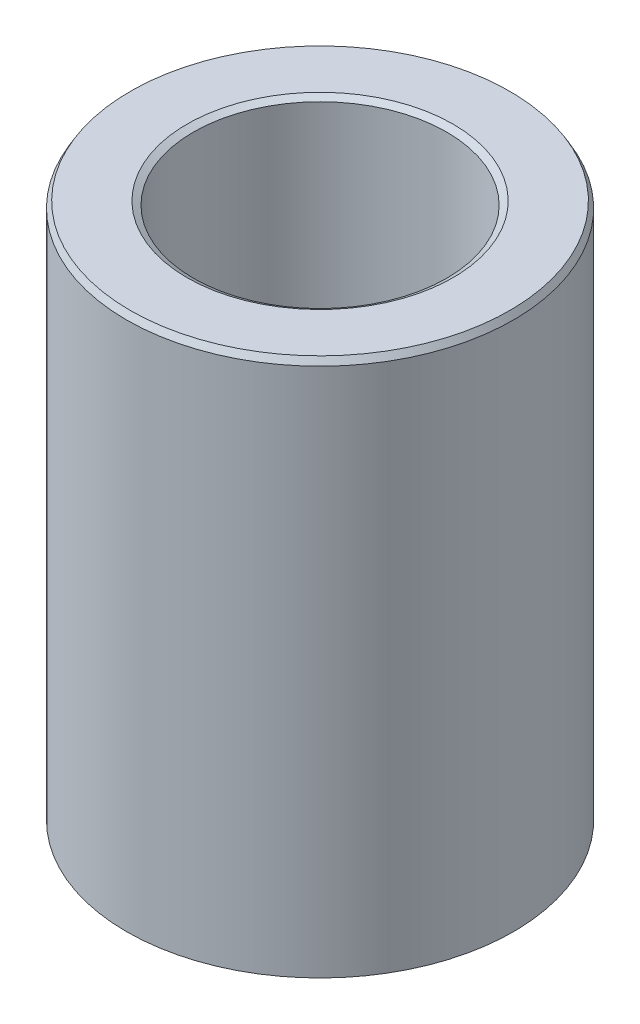
ISO-10303-21;
HEADER;
FILE_DESCRIPTION(('STEP AP214'),'2;1');
FILE_NAME('part.step','',(''),(''),'','','');
FILE_SCHEMA(('AUTOMOTIVE_DESIGN { 1 0 10303 214 1 1 1 1 }'));
ENDSEC;
DATA;
#1=APPLICATION_CONTEXT('core data for automotive mechanical design processes');
#2=APPLICATION_PROTOCOL_DEFINITION('international standard','automotive_design',2000,#1);
#3=PRODUCT_CONTEXT('',#1,'mechanical');
#4=PRODUCT('Part','Part','',(#3));
#5=PRODUCT_RELATED_PRODUCT_CATEGORY('part','',(#4));
#6=PRODUCT_DEFINITION_FORMATION('','',#4);
#7=PRODUCT_DEFINITION_CONTEXT('part definition',#1,'design');
#8=PRODUCT_DEFINITION('design','',#6,#7);
#9=PRODUCT_DEFINITION_SHAPE('','',#8);
#10=(LENGTH_UNIT() NAMED_UNIT(*) SI_UNIT(.MILLI.,.METRE.));
#11=(NAMED_UNIT(*) PLANE_ANGLE_UNIT() SI_UNIT($,.RADIAN.));
#12=(NAMED_UNIT(*) SI_UNIT($,.STERADIAN.) SOLID_ANGLE_UNIT());
#13=UNCERTAINTY_MEASURE_WITH_UNIT(LENGTH_MEASURE(1.E-05),#10,'distance_accuracy_value','');
#14=(GEOMETRIC_REPRESENTATION_CONTEXT(3) GLOBAL_UNCERTAINTY_ASSIGNED_CONTEXT((#13)) GLOBAL_UNIT_ASSIGNED_CONTEXT((#10,
#11,#12)) REPRESENTATION_CONTEXT('',''));
#15=CARTESIAN_POINT('',(0.,0.,0.));
#16=DIRECTION('',(0.,0.,1.));
#17=DIRECTION('',(1.,0.,0.));
#18=AXIS2_PLACEMENT_3D('',#15,#16,#17);
#19=CARTESIAN_POINT('',(0.,104.640393123507,0.));
#20=DIRECTION('',(0.,-1.,0.));
#21=DIRECTION('',(0.,0.,-1.));
#22=AXIS2_PLACEMENT_3D('',#19,#20,#21);
#23=CYLINDRICAL_SURFACE('',#22,37.5);
#24=CARTESIAN_POINT('',(0.,0.714431861445083,0.));
#25=DIRECTION('',(0.,1.,0.));
#26=DIRECTION('',(0.,0.,1.));
#27=AXIS2_PLACEMENT_3D('',#24,#25,#26);
#28=CIRCLE('',#27,37.5);
#29=CARTESIAN_POINT('',(0.,0.714431861445083,37.5));
#30=VERTEX_POINT('',#29);
#31=EDGE_CURVE('E10',#30,#30,#28,.T.);
#32=ORIENTED_EDGE('',*,*,#31,.T.);
#33=EDGE_LOOP('',(#32));
#34=FACE_BOUND('',#33,.T.);
#35=CARTESIAN_POINT('',(0.,103.402960840938,0.));
#36=DIRECTION('',(0.,1.,0.));
#37=DIRECTION('',(0.,0.,1.));
#38=AXIS2_PLACEMENT_3D('',#35,#36,#37);
#39=CIRCLE('',#38,37.5);
#40=CARTESIAN_POINT('',(0.,103.402960840938,37.5));
#41=VERTEX_POINT('',#40);
#42=EDGE_CURVE('E50',#41,#41,#39,.F.);
#43=ORIENTED_EDGE('',*,*,#42,.T.);
#44=EDGE_LOOP('',(#43));
#45=FACE_BOUND('',#44,.T.);
#46=ADVANCED_FACE('F39',(#34,#45),#23,.T.);
#47=CARTESIAN_POINT('',(0.,104.640393123507,0.));
#48=DIRECTION('',(0.,1.,0.));
#49=DIRECTION('',(0.,0.,1.));
#50=AXIS2_PLACEMENT_3D('',#47,#48,#49);
#51=PLANE('',#50);
#52=CARTESIAN_POINT('',(0.,104.640393123507,0.));
#53=DIRECTION('',(0.,1.,0.));
#54=DIRECTION('',(0.,0.,1.));
#55=AXIS2_PLACEMENT_3D('',#52,#53,#54);
#56=CIRCLE('',#55,25.7845045685845);
#57=CARTESIAN_POINT('',(0.,104.640393123507,25.7845045685845));
#58=VERTEX_POINT('',#57);
#59=EDGE_CURVE('E58',#58,#58,#56,.F.);
#60=ORIENTED_EDGE('',*,*,#59,.T.);
#61=EDGE_LOOP('',(#60));
#62=FACE_BOUND('',#61,.T.);
#63=CARTESIAN_POINT('',(0.,104.640393123507,0.));
#64=DIRECTION('',(0.,1.,0.));
#65=DIRECTION('',(0.,0.,1.));
#66=AXIS2_PLACEMENT_3D('',#63,#64,#65);
#67=CIRCLE('',#66,36.7855681385549);
#68=CARTESIAN_POINT('',(0.,104.640393123507,36.7855681385549));
#69=VERTEX_POINT('',#68);
#70=EDGE_CURVE('E61',#69,#69,#67,.T.);
#71=ORIENTED_EDGE('',*,*,#70,.T.);
#72=EDGE_LOOP('',(#71));
#73=FACE_BOUND('',#72,.T.);
#74=ADVANCED_FACE('F88',(#62,#73),#51,.T.);
#75=CARTESIAN_POINT('',(0.,0.,0.));
#76=DIRECTION('',(0.,1.,0.));
#77=DIRECTION('',(0.,0.,1.));
#78=AXIS2_PLACEMENT_3D('',#75,#76,#77);
#79=PLANE('',#78);
#80=CARTESIAN_POINT('',(0.,0.,0.));
#81=DIRECTION('',(0.,1.,0.));
#82=DIRECTION('',(0.,0.,1.));
#83=AXIS2_PLACEMENT_3D('',#80,#81,#82);
#84=CIRCLE('',#83,25.2615041474607);
#85=CARTESIAN_POINT('',(0.,0.,25.2615041474607));
#86=VERTEX_POINT('',#85);
#87=EDGE_CURVE('E51',#86,#86,#84,.T.);
#88=ORIENTED_EDGE('',*,*,#87,.T.);
#89=EDGE_LOOP('',(#88));
#90=FACE_BOUND('',#89,.T.);
#91=CARTESIAN_POINT('',(0.,0.,0.));
#92=DIRECTION('',(0.,1.,0.));
#93=DIRECTION('',(0.,0.,1.));
#94=AXIS2_PLACEMENT_3D('',#91,#92,#93);
#95=CIRCLE('',#94,36.2625677174311);
#96=CARTESIAN_POINT('',(0.,0.,36.2625677174311));
#97=VERTEX_POINT('',#96);
#98=EDGE_CURVE('E54',#97,#97,#95,.F.);
#99=ORIENTED_EDGE('',*,*,#98,.T.);
#100=EDGE_LOOP('',(#99));
#101=FACE_BOUND('',#100,.T.);
#102=ADVANCED_FACE('F83',(#90,#101),#79,.F.);
#103=CARTESIAN_POINT('',(0.,104.640393123507,0.));
#104=DIRECTION('',(0.,-1.,0.));
#105=DIRECTION('',(0.,0.,-1.));
#106=AXIS2_PLACEMENT_3D('',#103,#104,#105);
#107=CYLINDRICAL_SURFACE('',#106,24.5470722860156);
#108=CARTESIAN_POINT('',(0.,103.925961262062,0.));
#109=DIRECTION('',(0.,1.,0.));
#110=DIRECTION('',(0.,0.,1.));
#111=AXIS2_PLACEMENT_3D('',#108,#109,#110);
#112=CIRCLE('',#111,24.5470722860156);
#113=CARTESIAN_POINT('',(0.,103.925961262062,24.5470722860156));
#114=VERTEX_POINT('',#113);
#115=EDGE_CURVE('E67',#114,#114,#112,.T.);
#116=ORIENTED_EDGE('',*,*,#115,.T.);
#117=EDGE_LOOP('',(#116));
#118=FACE_BOUND('',#117,.T.);
#119=CARTESIAN_POINT('',(0.,1.23743228256894,0.));
#120=DIRECTION('',(0.,1.,0.));
#121=DIRECTION('',(0.,0.,1.));
#122=AXIS2_PLACEMENT_3D('',#119,#120,#121);
#123=CIRCLE('',#122,24.5470722860156);
#124=CARTESIAN_POINT('',(0.,1.23743228256894,24.5470722860156));
#125=VERTEX_POINT('',#124);
#126=EDGE_CURVE('E69',#125,#125,#123,.F.);
#127=ORIENTED_EDGE('',*,*,#126,.T.);
#128=EDGE_LOOP('',(#127));
#129=FACE_BOUND('',#128,.T.);
#130=ADVANCED_FACE('F71',(#118,#129),#107,.F.);
#131=CARTESIAN_POINT('',(0.,103.925961262062,0.));
#132=DIRECTION('',(0.,1.,0.));
#133=DIRECTION('',(0.,0.,1.));
#134=AXIS2_PLACEMENT_3D('',#131,#132,#133);
#135=CONICAL_SURFACE('',#134,24.5470722860156,1.0471975511966);
#136=CARTESIAN_POINT('',(0.,104.640393123507,25.7845045685845));
#137=CARTESIAN_POINT('',(0.,104.63295112495,25.7716146489744));
#138=CARTESIAN_POINT('',(0.,104.625509126394,25.7587247293643));
#139=CARTESIAN_POINT('',(0.,104.61062512928,25.7329448901441));
#140=CARTESIAN_POINT('',(0.,104.603183130724,25.720054970534));
#141=CARTESIAN_POINT('',(0.,104.58829913361,25.6942751313138));
#142=CARTESIAN_POINT('',(0.,104.580857135053,25.6813852117037));
#143=CARTESIAN_POINT('',(0.,104.56597313794,25.6556053724836));
#144=CARTESIAN_POINT('',(0.,104.558531139383,25.6427154528735));
#145=CARTESIAN_POINT('',(0.,104.54364714227,25.6169356136533));
#146=CARTESIAN_POINT('',(0.,104.536205143713,25.6040456940432));
#147=CARTESIAN_POINT('',(0.,104.5213211466,25.578265854823));
#148=CARTESIAN_POINT('',(0.,104.513879148043,25.5653759352129));
#149=CARTESIAN_POINT('',(0.,104.498995150929,25.5395960959927));
#150=CARTESIAN_POINT('',(0.,104.491553152373,25.5267061763826));
#151=CARTESIAN_POINT('',(0.,104.476669155259,25.5009263371625));
#152=CARTESIAN_POINT('',(0.,104.469227156703,25.4880364175524));
#153=CARTESIAN_POINT('',(0.,104.454343159589,25.4622565783322));
#154=CARTESIAN_POINT('',(0.,104.446901161032,25.4493666587221));
#155=CARTESIAN_POINT('',(0.,104.432017163919,25.4235868195019));
#156=CARTESIAN_POINT('',(0.,104.424575165362,25.4106968998918));
#157=CARTESIAN_POINT('',(0.,104.409691168249,25.3849170606716));
#158=CARTESIAN_POINT('',(0.,104.402249169692,25.3720271410615));
#159=CARTESIAN_POINT('',(0.,104.387365172579,25.3462473018413));
#160=CARTESIAN_POINT('',(0.,104.379923174022,25.3333573822313));
#161=CARTESIAN_POINT('',(0.,104.365039176909,25.3075775430111));
#162=CARTESIAN_POINT('',(0.,104.357597178352,25.294687623401));
#163=CARTESIAN_POINT('',(0.,104.342713181238,25.2689077841808));
#164=CARTESIAN_POINT('',(0.,104.335271182682,25.2560178645707));
#165=CARTESIAN_POINT('',(0.,104.320387185568,25.2302380253505));
#166=CARTESIAN_POINT('',(0.,104.312945187011,25.2173481057404));
#167=CARTESIAN_POINT('',(0.,104.298061189898,25.1915682665202));
#168=CARTESIAN_POINT('',(0.,104.290619191341,25.1786783469101));
#169=CARTESIAN_POINT('',(0.,104.275735194228,25.15289850769));
#170=CARTESIAN_POINT('',(0.,104.268293195671,25.1400085880799));
#171=CARTESIAN_POINT('',(0.,104.253409198558,25.1142287488597));
#172=CARTESIAN_POINT('',(0.,104.245967200001,25.1013388292496));
#173=CARTESIAN_POINT('',(0.,104.231083202888,25.0755589900294));
#174=CARTESIAN_POINT('',(0.,104.223641204331,25.0626690704193));
#175=CARTESIAN_POINT('',(0.,104.208757207217,25.0368892311991));
#176=CARTESIAN_POINT('',(0.,104.201315208661,25.023999311589));
#177=CARTESIAN_POINT('',(0.,104.186431211547,24.9982194723689));
#178=CARTESIAN_POINT('',(0.,104.178989212991,24.9853295527588));
#179=CARTESIAN_POINT('',(0.,104.164105215877,24.9595497135386));
#180=CARTESIAN_POINT('',(0.,104.15666321732,24.9466597939285));
#181=CARTESIAN_POINT('',(0.,104.141779220207,24.9208799547083));
#182=CARTESIAN_POINT('',(0.,104.13433722165,24.9079900350982));
#183=CARTESIAN_POINT('',(0.,104.119453224537,24.882210195878));
#184=CARTESIAN_POINT('',(0.,104.11201122598,24.8693202762679));
#185=CARTESIAN_POINT('',(0.,104.097127228867,24.8435404370477));
#186=CARTESIAN_POINT('',(0.,104.08968523031,24.8306505174376));
#187=CARTESIAN_POINT('',(0.,104.074801233196,24.8048706782175));
#188=CARTESIAN_POINT('',(0.,104.06735923464,24.7919807586074));
#189=CARTESIAN_POINT('',(0.,104.052475237526,24.7662009193872));
#190=CARTESIAN_POINT('',(0.,104.04503323897,24.7533109997771));
#191=CARTESIAN_POINT('',(0.,104.030149241856,24.7275311605569));
#192=CARTESIAN_POINT('',(0.,104.022707243299,24.7146412409468));
#193=CARTESIAN_POINT('',(0.,104.007823246186,24.6888614017266));
#194=CARTESIAN_POINT('',(0.,104.000381247629,24.6759714821165));
#195=CARTESIAN_POINT('',(0.,103.985497250516,24.6501916428964));
#196=CARTESIAN_POINT('',(0.,103.978055251959,24.6373017232863));
#197=CARTESIAN_POINT('',(0.,103.963171254846,24.6115218840661));
#198=CARTESIAN_POINT('',(0.,103.955729256289,24.598631964456));
#199=CARTESIAN_POINT('',(0.,103.940845259175,24.5728521252358));
#200=CARTESIAN_POINT('',(0.,103.933403260619,24.5599622056257));
#201=CARTESIAN_POINT('',(0.,103.925961262062,24.5470722860156));
#202=B_SPLINE_CURVE_WITH_KNOTS('',3,(#136,#137,#138,#139,#140,#141,#142,#143,#144,#145,#146,
#147,#148,#149,#150,#151,#152,#153,#154,#155,#156,#157,#158,#159,#160,#161,#162,#163,#164,#165,
#166,#167,#168,#169,#170,#171,#172,#173,#174,#175,#176,#177,#178,#179,#180,#181,#182,#183,#184,
#185,#186,#187,#188,#189,#190,#191,#192,#193,#194,#195,#196,#197,#198,#199,#200,#201),
.UNSPECIFIED.,.F.,.F.,(4,2,2,2,2,2,2,2,2,2,2,2,2,2,2,2,2,2,2,2,2,2,2,2,2,2,2,2,2,2,2,2,4),(0.,
0.0446519913403189,0.0893039826806377,0.133955974020957,0.178607965361272,0.223259956701591,
0.267911948041903,0.312563939382222,0.357215930722541,0.401867922062857,0.446519913403176,
0.491171904743488,0.535823896083807,0.580475887424125,0.625127878764441,0.66977987010476,
0.714431861445072,0.759083852785391,0.80373584412571,0.848387835466026,0.893039826806345,
0.937691818146664,0.982343809486976,1.02699580082729,1.07164779216761,1.11629978350793,
1.16095177484825,1.20560376618856,1.25025575752888,1.29490774886919,1.33955974020951,
1.38421173154983,1.42886372289014),.UNSPECIFIED.);
#203=EDGE_CURVE('BSEAM77',#58,#114,#202,.T.);
#204=ORIENTED_EDGE('',*,*,#59,.F.);
#205=ORIENTED_EDGE('',*,*,#115,.F.);
#206=ORIENTED_EDGE('',*,*,#203,.T.);
#207=ORIENTED_EDGE('',*,*,#203,.F.);
#208=EDGE_LOOP('',(#204,#206,#205,#207));
#209=FACE_BOUND('',#208,.T.);
#210=ADVANCED_FACE('F77',(#209),#135,.F.);
#211=CARTESIAN_POINT('',(0.,0.,0.));
#212=DIRECTION('',(0.,-1.,0.));
#213=DIRECTION('',(0.,0.,-1.));
#214=AXIS2_PLACEMENT_3D('',#211,#212,#213);
#215=CONICAL_SURFACE('',#214,25.2615041474607,0.52359877559829);
#216=ORIENTED_EDGE('',*,*,#126,.F.);
#217=EDGE_LOOP('',(#216));
#218=FACE_BOUND('',#217,.T.);
#219=ORIENTED_EDGE('',*,*,#87,.F.);
#220=EDGE_LOOP('',(#219));
#221=FACE_BOUND('',#220,.T.);
#222=ADVANCED_FACE('F73',(#218,#221),#215,.F.);
#223=CARTESIAN_POINT('',(0.,0.714431861445083,0.));
#224=DIRECTION('',(0.,1.,0.));
#225=DIRECTION('',(0.,0.,1.));
#226=AXIS2_PLACEMENT_3D('',#223,#224,#225);
#227=CONICAL_SURFACE('',#226,37.5,1.04719755119661);
#228=ORIENTED_EDGE('',*,*,#98,.F.);
#229=EDGE_LOOP('',(#228));
#230=FACE_BOUND('',#229,.T.);
#231=ORIENTED_EDGE('',*,*,#31,.F.);
#232=EDGE_LOOP('',(#231));
#233=FACE_BOUND('',#232,.T.);
#234=ADVANCED_FACE('F76',(#230,#233),#227,.T.);
#235=CARTESIAN_POINT('',(0.,104.640393123507,0.));
#236=DIRECTION('',(0.,-1.,0.));
#237=DIRECTION('',(0.,0.,-1.));
#238=AXIS2_PLACEMENT_3D('',#235,#236,#237);
#239=CONICAL_SURFACE('',#238,36.7855681385549,0.523598775598297);
#240=ORIENTED_EDGE('',*,*,#42,.F.);
#241=EDGE_LOOP('',(#240));
#242=FACE_BOUND('',#241,.T.);
#243=ORIENTED_EDGE('',*,*,#70,.F.);
#244=EDGE_LOOP('',(#243));
#245=FACE_BOUND('',#244,.T.);
#246=ADVANCED_FACE('F45',(#242,#245),#239,.T.);
#247=CLOSED_SHELL('',(#46,#74,#102,#130,#210,#222,#234,#246));
#248=MANIFOLD_SOLID_BREP('B2',#247);
#249=ADVANCED_BREP_SHAPE_REPRESENTATION('',(#18,#248),#14);
#250=SHAPE_DEFINITION_REPRESENTATION(#9,#249);
ENDSEC;
END-ISO-10303-21;
